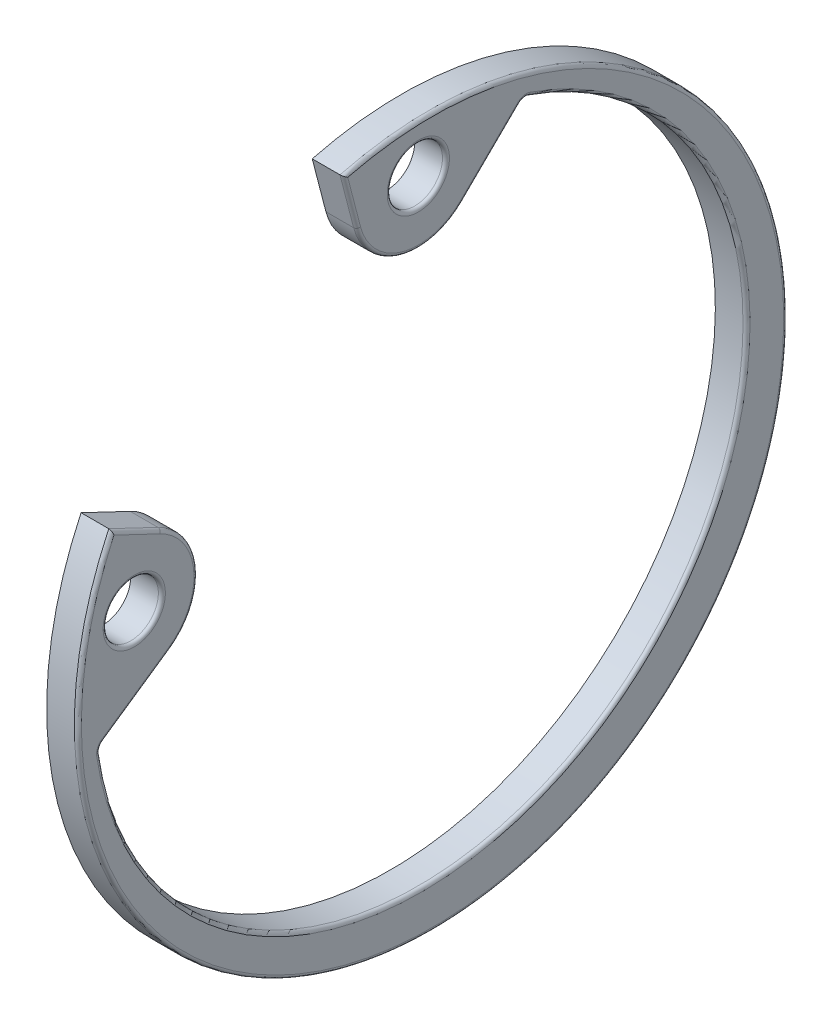
ISO-10303-21;
HEADER;
FILE_DESCRIPTION(('STEP AP214'),'2;1');
FILE_NAME('part.step','',(''),(''),'','','');
FILE_SCHEMA(('AUTOMOTIVE_DESIGN { 1 0 10303 214 1 1 1 1 }'));
ENDSEC;
DATA;
#1=APPLICATION_CONTEXT('core data for automotive mechanical design processes');
#2=APPLICATION_PROTOCOL_DEFINITION('international standard','automotive_design',2000,#1);
#3=PRODUCT_CONTEXT('',#1,'mechanical');
#4=PRODUCT('Part','Part','',(#3));
#5=PRODUCT_RELATED_PRODUCT_CATEGORY('part','',(#4));
#6=PRODUCT_DEFINITION_FORMATION('','',#4);
#7=PRODUCT_DEFINITION_CONTEXT('part definition',#1,'design');
#8=PRODUCT_DEFINITION('design','',#6,#7);
#9=PRODUCT_DEFINITION_SHAPE('','',#8);
#10=(LENGTH_UNIT() NAMED_UNIT(*) SI_UNIT(.MILLI.,.METRE.));
#11=(NAMED_UNIT(*) PLANE_ANGLE_UNIT() SI_UNIT($,.RADIAN.));
#12=(NAMED_UNIT(*) SI_UNIT($,.STERADIAN.) SOLID_ANGLE_UNIT());
#13=UNCERTAINTY_MEASURE_WITH_UNIT(LENGTH_MEASURE(1.E-05),#10,'distance_accuracy_value','');
#14=(GEOMETRIC_REPRESENTATION_CONTEXT(3) GLOBAL_UNCERTAINTY_ASSIGNED_CONTEXT((#13)) GLOBAL_UNIT_ASSIGNED_CONTEXT((#10,
#11,#12)) REPRESENTATION_CONTEXT('',''));
#15=CARTESIAN_POINT('',(0.,0.,0.));
#16=DIRECTION('',(0.,0.,1.));
#17=DIRECTION('',(1.,0.,0.));
#18=AXIS2_PLACEMENT_3D('',#15,#16,#17);
#19=CARTESIAN_POINT('',(0.89,-0.94437347459123,9.22877533610817));
#20=DIRECTION('',(1.,0.,0.));
#21=DIRECTION('',(0.,0.,-1.));
#22=AXIS2_PLACEMENT_3D('',#19,#20,#21);
#23=PLANE('',#22);
#24=CARTESIAN_POINT('',(0.89,8.74089053517137,0.405687887252676));
#25=DIRECTION('',(1.,0.,0.));
#26=DIRECTION('',(0.,0.,-1.));
#27=AXIS2_PLACEMENT_3D('',#24,#25,#26);
#28=CIRCLE('',#27,0.887399999999978);
#29=CARTESIAN_POINT('',(0.89,8.74089053517137,-0.481712112747302));
#30=VERTEX_POINT('',#29);
#31=EDGE_CURVE('E241',#30,#30,#28,.F.);
#32=ORIENTED_EDGE('',*,*,#31,.T.);
#33=EDGE_LOOP('',(#32));
#34=FACE_BOUND('',#33,.T.);
#35=CARTESIAN_POINT('',(0.89,8.88379246022824,-2.67214654899015));
#36=DIRECTION('',(1.,0.,0.));
#37=DIRECTION('',(0.,0.,-1.));
#38=AXIS2_PLACEMENT_3D('',#35,#36,#37);
#39=CIRCLE('',#38,0.354000000437606);
#40=CARTESIAN_POINT('',(0.89,9.13606218370444,-2.42380004322237));
#41=VERTEX_POINT('',#40);
#42=CARTESIAN_POINT('',(0.89,9.21781288839964,-2.78939139482152));
#43=VERTEX_POINT('',#42);
#44=EDGE_CURVE('E236',#41,#43,#39,.F.);
#45=ORIENTED_EDGE('',*,*,#44,.T.);
#46=CARTESIAN_POINT('',(0.89,0.37911789803553,0.313087806736716));
#47=DIRECTION('',(1.,0.,0.));
#48=DIRECTION('',(0.,0.,-1.));
#49=AXIS2_PLACEMENT_3D('',#46,#47,#48);
#50=CIRCLE('',#49,9.3673852450291);
#51=CARTESIAN_POINT('',(0.89,-0.996353496623198,9.57893826804163));
#52=VERTEX_POINT('',#51);
#53=EDGE_CURVE('E238',#43,#52,#50,.F.);
#54=ORIENTED_EDGE('',*,*,#53,.T.);
#55=CARTESIAN_POINT('',(0.89,-0.94437347459123,9.22877533610817));
#56=DIRECTION('',(1.,0.,0.));
#57=DIRECTION('',(0.,0.,-1.));
#58=AXIS2_PLACEMENT_3D('',#55,#56,#57);
#59=CIRCLE('',#58,0.354000002246724);
#60=CARTESIAN_POINT('',(0.89,-0.652811376367404,9.42954272506863));
#61=VERTEX_POINT('',#60);
#62=EDGE_CURVE('E220',#52,#61,#59,.F.);
#63=ORIENTED_EDGE('',*,*,#62,.T.);
#64=DIRECTION('',(0.,0.567139513119416,-0.823621741249387));
#65=VECTOR('',#64,1.);
#66=CARTESIAN_POINT('',(0.89,0.647978584774914,7.54048567999871));
#67=LINE('',#66,#65);
#68=CARTESIAN_POINT('',(0.89,0.647978584746839,7.54048568003948));
#69=VERTEX_POINT('',#68);
#70=EDGE_CURVE('E222',#61,#69,#67,.T.);
#71=ORIENTED_EDGE('',*,*,#70,.T.);
#72=CARTESIAN_POINT('',(0.89,2.05093585847453,8.50655112749294));
#73=DIRECTION('',(1.,0.,0.));
#74=DIRECTION('',(0.,0.,-1.));
#75=AXIS2_PLACEMENT_3D('',#72,#73,#74);
#76=CIRCLE('',#75,1.70340000019634);
#77=CARTESIAN_POINT('',(0.89,3.58905171428596,7.77458721118943));
#78=VERTEX_POINT('',#77);
#79=EDGE_CURVE('E224',#69,#78,#76,.T.);
#80=ORIENTED_EDGE('',*,*,#79,.T.);
#81=DIRECTION('',(0.,0.429707591985049,0.902968097659275));
#82=VECTOR('',#81,1.);
#83=CARTESIAN_POINT('',(0.89,4.25643186717224,9.17698967814012));
#84=LINE('',#83,#82);
#85=CARTESIAN_POINT('',(0.89,4.21324658262308,9.08624207450555));
#86=VERTEX_POINT('',#85);
#87=EDGE_CURVE('E226',#78,#86,#84,.T.);
#88=ORIENTED_EDGE('',*,*,#87,.T.);
#89=CARTESIAN_POINT('',(0.89,0.,0.));
#90=DIRECTION('',(1.,0.,0.));
#91=DIRECTION('',(0.,0.,-1.));
#92=AXIS2_PLACEMENT_3D('',#89,#90,#91);
#93=CIRCLE('',#92,10.01555);
#94=CARTESIAN_POINT('',(0.89,9.7189362692285,2.41940480225504));
#95=VERTEX_POINT('',#94);
#96=EDGE_CURVE('E228',#86,#95,#93,.T.);
#97=ORIENTED_EDGE('',*,*,#96,.T.);
#98=DIRECTION('',(0.,-0.96792441124204,-0.251241585176001));
#99=VECTOR('',#98,1.);
#100=CARTESIAN_POINT('',(0.89,8.31292562591993,2.05445032988474));
#101=LINE('',#100,#99);
#102=CARTESIAN_POINT('',(0.89,8.31292562594263,2.05445032989063));
#103=VERTEX_POINT('',#102);
#104=EDGE_CURVE('E230',#95,#103,#101,.T.);
#105=ORIENTED_EDGE('',*,*,#104,.T.);
#106=CARTESIAN_POINT('',(0.89,8.74089054125224,0.405687892758106));
#107=DIRECTION('',(1.,0.,0.));
#108=DIRECTION('',(0.,0.,-1.));
#109=AXIS2_PLACEMENT_3D('',#106,#107,#108);
#110=CIRCLE('',#109,1.70339999496159);
#111=CARTESIAN_POINT('',(0.89,7.52700284347939,-0.789321814328357));
#112=VERTEX_POINT('',#111);
#113=EDGE_CURVE('E232',#103,#112,#110,.T.);
#114=ORIENTED_EDGE('',*,*,#113,.T.);
#115=DIRECTION('',(0.,0.701543798907593,-0.712626338423092));
#116=VECTOR('',#115,1.);
#117=CARTESIAN_POINT('',(0.89,9.13606218388451,-2.42380004340528));
#118=LINE('',#117,#116);
#119=EDGE_CURVE('E234',#112,#41,#118,.T.);
#120=ORIENTED_EDGE('',*,*,#119,.T.);
#121=EDGE_LOOP('',(#45,#54,#63,#71,#80,#88,#97,#105,#114,#120));
#122=FACE_BOUND('',#121,.T.);
#123=CARTESIAN_POINT('',(0.89,2.05093585267198,8.50655112349735));
#124=DIRECTION('',(1.,0.,0.));
#125=DIRECTION('',(0.,0.,-1.));
#126=AXIS2_PLACEMENT_3D('',#123,#124,#125);
#127=CIRCLE('',#126,0.887399999999991);
#128=CARTESIAN_POINT('',(0.89,2.05093585267198,7.61915112349736));
#129=VERTEX_POINT('',#128);
#130=EDGE_CURVE('E217',#129,#129,#127,.F.);
#131=ORIENTED_EDGE('',*,*,#130,.T.);
#132=EDGE_LOOP('',(#131));
#133=FACE_BOUND('',#132,.T.);
#134=ADVANCED_FACE('F33',(#34,#122,#133),#23,.T.);
#135=CARTESIAN_POINT('',(0.,-0.94437347459123,9.22877533610817));
#136=DIRECTION('',(1.,0.,0.));
#137=DIRECTION('',(0.,0.,-1.));
#138=AXIS2_PLACEMENT_3D('',#135,#136,#137);
#139=PLANE('',#138);
#140=CARTESIAN_POINT('',(0.,-0.94437347459123,9.22877533610817));
#141=DIRECTION('',(-1.,0.,0.));
#142=DIRECTION('',(0.,0.,-1.));
#143=AXIS2_PLACEMENT_3D('',#140,#141,#142);
#144=CIRCLE('',#143,0.254000002246724);
#145=CARTESIAN_POINT('',(0.,-0.981669875114318,9.4800221861369));
#146=VERTEX_POINT('',#145);
#147=CARTESIAN_POINT('',(0.,-0.735173550492341,9.37282877375669));
#148=VERTEX_POINT('',#147);
#149=EDGE_CURVE('E162',#146,#148,#144,.T.);
#150=ORIENTED_EDGE('',*,*,#149,.F.);
#151=CARTESIAN_POINT('',(0.,0.37911789803553,0.313087806736716));
#152=DIRECTION('',(-1.,0.,0.));
#153=DIRECTION('',(0.,0.,-1.));
#154=AXIS2_PLACEMENT_3D('',#151,#152,#153);
#155=CIRCLE('',#154,9.2673852450291);
#156=CARTESIAN_POINT('',(0.,9.12345683535854,-2.75627138192139));
#157=VERTEX_POINT('',#156);
#158=EDGE_CURVE('E197',#157,#146,#155,.T.);
#159=ORIENTED_EDGE('',*,*,#158,.F.);
#160=CARTESIAN_POINT('',(0.,8.88379246022824,-2.67214654899015));
#161=DIRECTION('',(-1.,0.,0.));
#162=DIRECTION('',(0.,0.,-1.));
#163=AXIS2_PLACEMENT_3D('',#160,#161,#162);
#164=CIRCLE('',#163,0.254000000437606);
#165=CARTESIAN_POINT('',(0.,9.0647995500422,-2.49395442329604));
#166=VERTEX_POINT('',#165);
#167=EDGE_CURVE('E194',#166,#157,#164,.T.);
#168=ORIENTED_EDGE('',*,*,#167,.F.);
#169=DIRECTION('',(0.,0.701543798907593,-0.712626338423092));
#170=VECTOR('',#169,1.);
#171=CARTESIAN_POINT('',(0.,7.45574020963708,-0.859476194219118));
#172=LINE('',#171,#170);
#173=CARTESIAN_POINT('',(0.,7.45574020963708,-0.859476194219116));
#174=VERTEX_POINT('',#173);
#175=EDGE_CURVE('E191',#174,#166,#172,.T.);
#176=ORIENTED_EDGE('',*,*,#175,.F.);
#177=CARTESIAN_POINT('',(0.,8.74089054125224,0.405687892758106));
#178=DIRECTION('',(1.,0.,0.));
#179=DIRECTION('',(0.,0.,-1.));
#180=AXIS2_PLACEMENT_3D('',#177,#178,#179);
#181=CIRCLE('',#180,1.80339999496159);
#182=CARTESIAN_POINT('',(0.,8.28780146740233,2.15124277100894));
#183=VERTEX_POINT('',#182);
#184=EDGE_CURVE('E188',#183,#174,#181,.T.);
#185=ORIENTED_EDGE('',*,*,#184,.F.);
#186=DIRECTION('',(0.,-0.96792441124204,-0.251241585176));
#187=VECTOR('',#186,1.);
#188=CARTESIAN_POINT('',(0.,9.79108777455335,2.54144683074264));
#189=LINE('',#188,#187);
#190=CARTESIAN_POINT('',(0.,9.79108777455335,2.54144683074265));
#191=VERTEX_POINT('',#190);
#192=EDGE_CURVE('E185',#191,#183,#189,.T.);
#193=ORIENTED_EDGE('',*,*,#192,.F.);
#194=CARTESIAN_POINT('',(0.,0.,0.));
#195=DIRECTION('',(1.,0.,0.));
#196=DIRECTION('',(0.,0.,-1.));
#197=AXIS2_PLACEMENT_3D('',#194,#195,#196);
#198=CIRCLE('',#197,10.11555);
#199=CARTESIAN_POINT('',(0.,4.34672867693816,9.13401891894162));
#200=VERTEX_POINT('',#199);
#201=EDGE_CURVE('E182',#200,#191,#198,.T.);
#202=ORIENTED_EDGE('',*,*,#201,.F.);
#203=DIRECTION('',(0.,0.429707591985049,0.902968097659275));
#204=VECTOR('',#203,1.);
#205=CARTESIAN_POINT('',(0.,3.67934852405189,7.73161645199092));
#206=LINE('',#205,#204);
#207=CARTESIAN_POINT('',(0.,3.67934852405189,7.73161645199092));
#208=VERTEX_POINT('',#207);
#209=EDGE_CURVE('E179',#208,#200,#206,.T.);
#210=ORIENTED_EDGE('',*,*,#209,.F.);
#211=CARTESIAN_POINT('',(0.,2.05093585847453,8.50655112749294));
#212=DIRECTION('',(1.,0.,0.));
#213=DIRECTION('',(0.,0.,-1.));
#214=AXIS2_PLACEMENT_3D('',#211,#212,#213);
#215=CIRCLE('',#214,1.80340000019634);
#216=CARTESIAN_POINT('',(0.,0.565616410649975,7.48377172868677));
#217=VERTEX_POINT('',#216);
#218=EDGE_CURVE('E165',#217,#208,#215,.T.);
#219=ORIENTED_EDGE('',*,*,#218,.F.);
#220=DIRECTION('',(0.,0.567139513119416,-0.823621741249387));
#221=VECTOR('',#220,1.);
#222=CARTESIAN_POINT('',(0.,-0.735173550492341,9.37282877375669));
#223=LINE('',#222,#221);
#224=EDGE_CURVE('E149',#148,#217,#223,.T.);
#225=ORIENTED_EDGE('',*,*,#224,.F.);
#226=EDGE_LOOP('',(#150,#159,#168,#176,#185,#193,#202,#210,#219,#225));
#227=FACE_BOUND('',#226,.T.);
#228=CARTESIAN_POINT('',(0.,2.05093585267198,8.50655112349735));
#229=DIRECTION('',(1.,0.,0.));
#230=DIRECTION('',(0.,0.,-1.));
#231=AXIS2_PLACEMENT_3D('',#228,#229,#230);
#232=CIRCLE('',#231,0.787399999999991);
#233=CARTESIAN_POINT('',(0.,2.05093585267198,7.71915112349736));
#234=VERTEX_POINT('',#233);
#235=EDGE_CURVE('E171',#234,#234,#232,.T.);
#236=ORIENTED_EDGE('',*,*,#235,.T.);
#237=EDGE_LOOP('',(#236));
#238=FACE_BOUND('',#237,.T.);
#239=CARTESIAN_POINT('',(0.,8.74089053517137,0.405687887252676));
#240=DIRECTION('',(1.,0.,0.));
#241=DIRECTION('',(0.,0.,-1.));
#242=AXIS2_PLACEMENT_3D('',#239,#240,#241);
#243=CIRCLE('',#242,0.787399999999977);
#244=CARTESIAN_POINT('',(0.,8.74089053517137,-0.381712112747302));
#245=VERTEX_POINT('',#244);
#246=EDGE_CURVE('E174',#245,#245,#243,.T.);
#247=ORIENTED_EDGE('',*,*,#246,.T.);
#248=EDGE_LOOP('',(#247));
#249=FACE_BOUND('',#248,.T.);
#250=ADVANCED_FACE('F159',(#227,#238,#249),#139,.F.);
#251=CARTESIAN_POINT('',(0.89,-0.94437347459123,9.22877533610817));
#252=DIRECTION('',(-1.,0.,0.));
#253=DIRECTION('',(0.,0.,1.));
#254=AXIS2_PLACEMENT_3D('',#251,#252,#253);
#255=CYLINDRICAL_SURFACE('',#254,0.254000002246724);
#256=DIRECTION('',(-1.,0.,0.));
#257=VECTOR('',#256,1.);
#258=CARTESIAN_POINT('',(0.89,-0.735173550492341,9.37282877375669));
#259=LINE('',#258,#257);
#260=CARTESIAN_POINT('',(0.79,-0.735173550492341,9.37282877375669));
#261=VERTEX_POINT('',#260);
#262=EDGE_CURVE('E146',#261,#148,#259,.T.);
#263=ORIENTED_EDGE('',*,*,#262,.F.);
#264=CARTESIAN_POINT('',(0.79,-0.94437347459123,9.22877533610817));
#265=DIRECTION('',(1.,0.,0.));
#266=DIRECTION('',(0.,0.,-1.));
#267=AXIS2_PLACEMENT_3D('',#264,#265,#266);
#268=CIRCLE('',#267,0.254000002246724);
#269=CARTESIAN_POINT('',(0.79,-0.981669875114318,9.4800221861369));
#270=VERTEX_POINT('',#269);
#271=EDGE_CURVE('E47',#261,#270,#268,.T.);
#272=ORIENTED_EDGE('',*,*,#271,.T.);
#273=DIRECTION('',(-1.,0.,0.));
#274=VECTOR('',#273,1.);
#275=CARTESIAN_POINT('',(0.89,-0.981669875114318,9.4800221861369));
#276=LINE('',#275,#274);
#277=EDGE_CURVE('E169',#270,#146,#276,.T.);
#278=ORIENTED_EDGE('',*,*,#277,.T.);
#279=ORIENTED_EDGE('',*,*,#149,.T.);
#280=EDGE_LOOP('',(#263,#272,#278,#279));
#281=FACE_BOUND('',#280,.T.);
#282=ADVANCED_FACE('F167',(#281),#255,.F.);
#283=CARTESIAN_POINT('',(0.89,-0.735173550492341,9.37282877375669));
#284=DIRECTION('',(0.,0.823621741249387,0.567139513119416));
#285=DIRECTION('',(0.,-0.567139513119416,0.823621741249387));
#286=AXIS2_PLACEMENT_3D('',#283,#284,#285);
#287=PLANE('',#286);
#288=DIRECTION('',(-1.,0.,0.));
#289=VECTOR('',#288,1.);
#290=CARTESIAN_POINT('',(0.89,0.565616410649975,7.48377172868677));
#291=LINE('',#290,#289);
#292=CARTESIAN_POINT('',(0.79,0.565616410649975,7.48377172868677));
#293=VERTEX_POINT('',#292);
#294=EDGE_CURVE('E155',#293,#217,#291,.T.);
#295=ORIENTED_EDGE('',*,*,#294,.F.);
#296=DIRECTION('',(0.,0.567139513119416,-0.823621741249387));
#297=VECTOR('',#296,1.);
#298=CARTESIAN_POINT('',(0.79,-0.735173550492341,9.37282877375669));
#299=LINE('',#298,#297);
#300=EDGE_CURVE('E55',#293,#261,#299,.F.);
#301=ORIENTED_EDGE('',*,*,#300,.T.);
#302=ORIENTED_EDGE('',*,*,#262,.T.);
#303=ORIENTED_EDGE('',*,*,#224,.T.);
#304=EDGE_LOOP('',(#295,#301,#302,#303));
#305=FACE_BOUND('',#304,.T.);
#306=ADVANCED_FACE('F148',(#305),#287,.F.);
#307=CARTESIAN_POINT('',(0.89,2.05093585847453,8.50655112749294));
#308=DIRECTION('',(-1.,0.,0.));
#309=DIRECTION('',(0.,0.,1.));
#310=AXIS2_PLACEMENT_3D('',#307,#308,#309);
#311=CYLINDRICAL_SURFACE('',#310,1.80340000019634);
#312=DIRECTION('',(-1.,0.,0.));
#313=VECTOR('',#312,1.);
#314=CARTESIAN_POINT('',(0.89,3.67934852405189,7.73161645199092));
#315=LINE('',#314,#313);
#316=CARTESIAN_POINT('',(0.79,3.67934852405189,7.73161645199092));
#317=VERTEX_POINT('',#316);
#318=EDGE_CURVE('E212',#317,#208,#315,.T.);
#319=ORIENTED_EDGE('',*,*,#318,.F.);
#320=CARTESIAN_POINT('',(0.79,2.05093585847453,8.50655112749294));
#321=DIRECTION('',(1.,0.,0.));
#322=DIRECTION('',(0.,0.,-1.));
#323=AXIS2_PLACEMENT_3D('',#320,#321,#322);
#324=CIRCLE('',#323,1.80340000019634);
#325=EDGE_CURVE('E63',#317,#293,#324,.F.);
#326=ORIENTED_EDGE('',*,*,#325,.T.);
#327=ORIENTED_EDGE('',*,*,#294,.T.);
#328=ORIENTED_EDGE('',*,*,#218,.T.);
#329=EDGE_LOOP('',(#319,#326,#327,#328));
#330=FACE_BOUND('',#329,.T.);
#331=ADVANCED_FACE('F348',(#330),#311,.T.);
#332=CARTESIAN_POINT('',(0.89,3.67934852405189,7.73161645199092));
#333=DIRECTION('',(0.,-0.902968097659275,0.429707591985049));
#334=DIRECTION('',(0.,-0.429707591985049,-0.902968097659275));
#335=AXIS2_PLACEMENT_3D('',#332,#333,#334);
#336=PLANE('',#335);
#337=DIRECTION('',(-1.,0.,0.));
#338=VECTOR('',#337,1.);
#339=CARTESIAN_POINT('',(0.89,4.34672867693816,9.13401891894162));
#340=LINE('',#339,#338);
#341=CARTESIAN_POINT('',(0.79,4.34672867693816,9.13401891894162));
#342=VERTEX_POINT('',#341);
#343=EDGE_CURVE('E210',#342,#200,#340,.T.);
#344=ORIENTED_EDGE('',*,*,#343,.F.);
#345=DIRECTION('',(0.,0.429707591985049,0.902968097659275));
#346=VECTOR('',#345,1.);
#347=CARTESIAN_POINT('',(0.79,3.67934852405189,7.73161645199092));
#348=LINE('',#347,#346);
#349=EDGE_CURVE('E257',#342,#317,#348,.F.);
#350=ORIENTED_EDGE('',*,*,#349,.T.);
#351=ORIENTED_EDGE('',*,*,#318,.T.);
#352=ORIENTED_EDGE('',*,*,#209,.T.);
#353=EDGE_LOOP('',(#344,#350,#351,#352));
#354=FACE_BOUND('',#353,.T.);
#355=ADVANCED_FACE('F344',(#354),#336,.F.);
#356=CARTESIAN_POINT('',(0.89,0.,0.));
#357=DIRECTION('',(-1.,0.,0.));
#358=DIRECTION('',(0.,0.,1.));
#359=AXIS2_PLACEMENT_3D('',#356,#357,#358);
#360=CYLINDRICAL_SURFACE('',#359,10.11555);
#361=DIRECTION('',(-1.,0.,0.));
#362=VECTOR('',#361,1.);
#363=CARTESIAN_POINT('',(0.89,9.79108777455335,2.54144683074265));
#364=LINE('',#363,#362);
#365=CARTESIAN_POINT('',(0.79,9.79108777455335,2.54144683074265));
#366=VERTEX_POINT('',#365);
#367=EDGE_CURVE('E208',#366,#191,#364,.T.);
#368=ORIENTED_EDGE('',*,*,#367,.F.);
#369=CARTESIAN_POINT('',(0.79,0.,0.));
#370=DIRECTION('',(1.,0.,0.));
#371=DIRECTION('',(0.,0.,-1.));
#372=AXIS2_PLACEMENT_3D('',#369,#370,#371);
#373=CIRCLE('',#372,10.11555);
#374=EDGE_CURVE('E255',#366,#342,#373,.F.);
#375=ORIENTED_EDGE('',*,*,#374,.T.);
#376=ORIENTED_EDGE('',*,*,#343,.T.);
#377=ORIENTED_EDGE('',*,*,#201,.T.);
#378=EDGE_LOOP('',(#368,#375,#376,#377));
#379=FACE_BOUND('',#378,.T.);
#380=ADVANCED_FACE('F340',(#379),#360,.T.);
#381=CARTESIAN_POINT('',(0.89,9.79108777455335,2.54144683074264));
#382=DIRECTION('',(0.,0.251241585176001,-0.96792441124204));
#383=DIRECTION('',(0.,0.96792441124204,0.251241585176001));
#384=AXIS2_PLACEMENT_3D('',#381,#382,#383);
#385=PLANE('',#384);
#386=DIRECTION('',(-1.,0.,0.));
#387=VECTOR('',#386,1.);
#388=CARTESIAN_POINT('',(0.89,8.28780146740233,2.15124277100894));
#389=LINE('',#388,#387);
#390=CARTESIAN_POINT('',(0.79,8.28780146740233,2.15124277100894));
#391=VERTEX_POINT('',#390);
#392=EDGE_CURVE('E206',#391,#183,#389,.T.);
#393=ORIENTED_EDGE('',*,*,#392,.F.);
#394=DIRECTION('',(0.,-0.96792441124204,-0.251241585176001));
#395=VECTOR('',#394,1.);
#396=CARTESIAN_POINT('',(0.79,9.79108777455335,2.54144683074264));
#397=LINE('',#396,#395);
#398=EDGE_CURVE('E253',#391,#366,#397,.F.);
#399=ORIENTED_EDGE('',*,*,#398,.T.);
#400=ORIENTED_EDGE('',*,*,#367,.T.);
#401=ORIENTED_EDGE('',*,*,#192,.T.);
#402=EDGE_LOOP('',(#393,#399,#400,#401));
#403=FACE_BOUND('',#402,.T.);
#404=ADVANCED_FACE('F336',(#403),#385,.F.);
#405=CARTESIAN_POINT('',(0.89,8.74089054125224,0.405687892758106));
#406=DIRECTION('',(-1.,0.,0.));
#407=DIRECTION('',(0.,0.,1.));
#408=AXIS2_PLACEMENT_3D('',#405,#406,#407);
#409=CYLINDRICAL_SURFACE('',#408,1.80339999496159);
#410=DIRECTION('',(-1.,0.,0.));
#411=VECTOR('',#410,1.);
#412=CARTESIAN_POINT('',(0.89,7.45574020963708,-0.859476194219116));
#413=LINE('',#412,#411);
#414=CARTESIAN_POINT('',(0.79,7.45574020963708,-0.859476194219116));
#415=VERTEX_POINT('',#414);
#416=EDGE_CURVE('E204',#415,#174,#413,.T.);
#417=ORIENTED_EDGE('',*,*,#416,.F.);
#418=CARTESIAN_POINT('',(0.79,8.74089054125224,0.405687892758106));
#419=DIRECTION('',(1.,0.,0.));
#420=DIRECTION('',(0.,0.,-1.));
#421=AXIS2_PLACEMENT_3D('',#418,#419,#420);
#422=CIRCLE('',#421,1.80339999496159);
#423=EDGE_CURVE('E251',#415,#391,#422,.F.);
#424=ORIENTED_EDGE('',*,*,#423,.T.);
#425=ORIENTED_EDGE('',*,*,#392,.T.);
#426=ORIENTED_EDGE('',*,*,#184,.T.);
#427=EDGE_LOOP('',(#417,#424,#425,#426));
#428=FACE_BOUND('',#427,.T.);
#429=ADVANCED_FACE('F332',(#428),#409,.T.);
#430=CARTESIAN_POINT('',(0.89,7.45574020963708,-0.859476194219118));
#431=DIRECTION('',(0.,0.712626338423092,0.701543798907593));
#432=DIRECTION('',(0.,-0.701543798907593,0.712626338423092));
#433=AXIS2_PLACEMENT_3D('',#430,#431,#432);
#434=PLANE('',#433);
#435=DIRECTION('',(-1.,0.,0.));
#436=VECTOR('',#435,1.);
#437=CARTESIAN_POINT('',(0.89,9.0647995500422,-2.49395442329604));
#438=LINE('',#437,#436);
#439=CARTESIAN_POINT('',(0.79,9.0647995500422,-2.49395442329604));
#440=VERTEX_POINT('',#439);
#441=EDGE_CURVE('E202',#440,#166,#438,.T.);
#442=ORIENTED_EDGE('',*,*,#441,.F.);
#443=DIRECTION('',(0.,0.701543798907593,-0.712626338423092));
#444=VECTOR('',#443,1.);
#445=CARTESIAN_POINT('',(0.79,7.45574020963708,-0.859476194219118));
#446=LINE('',#445,#444);
#447=EDGE_CURVE('E249',#440,#415,#446,.F.);
#448=ORIENTED_EDGE('',*,*,#447,.T.);
#449=ORIENTED_EDGE('',*,*,#416,.T.);
#450=ORIENTED_EDGE('',*,*,#175,.T.);
#451=EDGE_LOOP('',(#442,#448,#449,#450));
#452=FACE_BOUND('',#451,.T.);
#453=ADVANCED_FACE('F328',(#452),#434,.F.);
#454=CARTESIAN_POINT('',(0.89,8.88379246022824,-2.67214654899015));
#455=DIRECTION('',(-1.,0.,0.));
#456=DIRECTION('',(0.,0.,1.));
#457=AXIS2_PLACEMENT_3D('',#454,#455,#456);
#458=CYLINDRICAL_SURFACE('',#457,0.254000000437606);
#459=DIRECTION('',(-1.,0.,0.));
#460=VECTOR('',#459,1.);
#461=CARTESIAN_POINT('',(0.89,9.12345683535854,-2.75627138192139));
#462=LINE('',#461,#460);
#463=CARTESIAN_POINT('',(0.79,9.12345683535854,-2.75627138192139));
#464=VERTEX_POINT('',#463);
#465=EDGE_CURVE('E200',#464,#157,#462,.T.);
#466=ORIENTED_EDGE('',*,*,#465,.F.);
#467=CARTESIAN_POINT('',(0.79,8.88379246022824,-2.67214654899015));
#468=DIRECTION('',(1.,0.,0.));
#469=DIRECTION('',(0.,0.,-1.));
#470=AXIS2_PLACEMENT_3D('',#467,#468,#469);
#471=CIRCLE('',#470,0.254000000437606);
#472=EDGE_CURVE('E247',#464,#440,#471,.T.);
#473=ORIENTED_EDGE('',*,*,#472,.T.);
#474=ORIENTED_EDGE('',*,*,#441,.T.);
#475=ORIENTED_EDGE('',*,*,#167,.T.);
#476=EDGE_LOOP('',(#466,#473,#474,#475));
#477=FACE_BOUND('',#476,.T.);
#478=ADVANCED_FACE('F324',(#477),#458,.F.);
#479=CARTESIAN_POINT('',(0.89,0.37911789803553,0.313087806736716));
#480=DIRECTION('',(-1.,0.,0.));
#481=DIRECTION('',(0.,0.,1.));
#482=AXIS2_PLACEMENT_3D('',#479,#480,#481);
#483=CYLINDRICAL_SURFACE('',#482,9.2673852450291);
#484=ORIENTED_EDGE('',*,*,#277,.F.);
#485=CARTESIAN_POINT('',(0.79,0.37911789803553,0.313087806736716));
#486=DIRECTION('',(1.,0.,0.));
#487=DIRECTION('',(0.,0.,-1.));
#488=AXIS2_PLACEMENT_3D('',#485,#486,#487);
#489=CIRCLE('',#488,9.2673852450291);
#490=EDGE_CURVE('E244',#270,#464,#489,.T.);
#491=ORIENTED_EDGE('',*,*,#490,.T.);
#492=ORIENTED_EDGE('',*,*,#465,.T.);
#493=ORIENTED_EDGE('',*,*,#158,.T.);
#494=EDGE_LOOP('',(#484,#491,#492,#493));
#495=FACE_BOUND('',#494,.T.);
#496=ADVANCED_FACE('F321',(#495),#483,.F.);
#497=CARTESIAN_POINT('',(0.89,2.05093585267198,8.50655112349735));
#498=DIRECTION('',(-1.,0.,0.));
#499=DIRECTION('',(0.,0.,1.));
#500=AXIS2_PLACEMENT_3D('',#497,#498,#499);
#501=CYLINDRICAL_SURFACE('',#500,0.787399999999991);
#502=CARTESIAN_POINT('',(0.79,2.05093585267198,8.50655112349735));
#503=DIRECTION('',(1.,0.,0.));
#504=DIRECTION('',(0.,0.,-1.));
#505=AXIS2_PLACEMENT_3D('',#502,#503,#504);
#506=CIRCLE('',#505,0.787399999999991);
#507=CARTESIAN_POINT('',(0.79,2.05093585267198,7.71915112349736));
#508=VERTEX_POINT('',#507);
#509=EDGE_CURVE('E11',#508,#508,#506,.T.);
#510=ORIENTED_EDGE('',*,*,#509,.T.);
#511=EDGE_LOOP('',(#510));
#512=FACE_BOUND('',#511,.T.);
#513=ORIENTED_EDGE('',*,*,#235,.F.);
#514=EDGE_LOOP('',(#513));
#515=FACE_BOUND('',#514,.T.);
#516=ADVANCED_FACE('F318',(#512,#515),#501,.F.);
#517=CARTESIAN_POINT('',(0.89,8.74089053517137,0.405687887252676));
#518=DIRECTION('',(-1.,0.,0.));
#519=DIRECTION('',(0.,0.,1.));
#520=AXIS2_PLACEMENT_3D('',#517,#518,#519);
#521=CYLINDRICAL_SURFACE('',#520,0.787399999999977);
#522=CARTESIAN_POINT('',(0.79,8.74089053517137,0.405687887252676));
#523=DIRECTION('',(1.,0.,0.));
#524=DIRECTION('',(0.,0.,-1.));
#525=AXIS2_PLACEMENT_3D('',#522,#523,#524);
#526=CIRCLE('',#525,0.787399999999977);
#527=CARTESIAN_POINT('',(0.79,8.74089053517137,-0.381712112747302));
#528=VERTEX_POINT('',#527);
#529=EDGE_CURVE('E154',#528,#528,#526,.T.);
#530=ORIENTED_EDGE('',*,*,#529,.T.);
#531=EDGE_LOOP('',(#530));
#532=FACE_BOUND('',#531,.T.);
#533=ORIENTED_EDGE('',*,*,#246,.F.);
#534=EDGE_LOOP('',(#533));
#535=FACE_BOUND('',#534,.T.);
#536=ADVANCED_FACE('F358',(#532,#535),#521,.F.);
#537=CARTESIAN_POINT('',(0.79,8.74089053517137,0.405687887252676));
#538=DIRECTION('',(1.,0.,0.));
#539=DIRECTION('',(0.,0.,-1.));
#540=AXIS2_PLACEMENT_3D('',#537,#538,#539);
#541=TOROIDAL_SURFACE('',#540,0.887399999999978,0.1);
#542=ORIENTED_EDGE('',*,*,#31,.F.);
#543=EDGE_LOOP('',(#542));
#544=FACE_BOUND('',#543,.T.);
#545=ORIENTED_EDGE('',*,*,#529,.F.);
#546=EDGE_LOOP('',(#545));
#547=FACE_BOUND('',#546,.T.);
#548=ADVANCED_FACE('F297',(#544,#547),#541,.T.);
#549=CARTESIAN_POINT('',(0.79,0.,0.));
#550=DIRECTION('',(1.,0.,0.));
#551=DIRECTION('',(0.,0.,-1.));
#552=AXIS2_PLACEMENT_3D('',#549,#550,#551);
#553=TOROIDAL_SURFACE('',#552,10.01555,0.1);
#554=CARTESIAN_POINT('',(0.79,4.34672867693816,9.13401891894162));
#555=CARTESIAN_POINT('',(0.794487451954682,4.34673875500211,9.13402246348739));
#556=CARTESIAN_POINT('',(0.798963558115462,4.3463268429482,9.13387622050107));
#557=CARTESIAN_POINT('',(0.807724473144493,4.34474684887549,9.13331507068113));
#558=CARTESIAN_POINT('',(0.81201060278404,4.34358534500622,9.13290250102691));
#559=CARTESIAN_POINT('',(0.820293857558006,4.34059538497308,9.13184011844747));
#560=CARTESIAN_POINT('',(0.824291737663343,4.33876875300578,9.1311909544074));
#561=CARTESIAN_POINT('',(0.831949546258281,4.33456009557264,9.129694605223));
#562=CARTESIAN_POINT('',(0.835608692475284,4.33217682719446,9.12884697691752));
#563=CARTESIAN_POINT('',(0.843961065708375,4.3259043039969,9.12661496952148));
#564=CARTESIAN_POINT('',(0.848469403795696,4.32179681528095,9.12515251218537));
#565=CARTESIAN_POINT('',(0.856728961036129,4.3129567606326,9.12200237159066));
#566=CARTESIAN_POINT('',(0.860478703454311,4.30822300462195,9.12031425946146));
#567=CARTESIAN_POINT('',(0.868569327932943,4.29639560395177,9.11609255820444));
#568=CARTESIAN_POINT('',(0.872574498765302,4.28909928536016,9.11348517383687));
#569=CARTESIAN_POINT('',(0.879302670534998,4.27400778250581,9.1080845979889));
#570=CARTESIAN_POINT('',(0.882024200887967,4.26621203763473,9.10529119756084));
#571=CARTESIAN_POINT('',(0.886041093565559,4.251223783303,9.09991282276679));
#572=CARTESIAN_POINT('',(0.887460776731901,4.2440597498302,9.09733890553612));
#573=CARTESIAN_POINT('',(0.889396245463372,4.22963861196235,9.09215091905138));
#574=CARTESIAN_POINT('',(0.889913793167325,4.22238171696207,9.08953693815696));
#575=CARTESIAN_POINT('',(0.88999669557293,4.21450080966692,9.08669451500589));
#576=CARTESIAN_POINT('',(0.889999994466216,4.2138736660813,9.08646829657466));
#577=CARTESIAN_POINT('',(0.89,4.21324658262308,9.08624207450555));
#578=B_SPLINE_CURVE_WITH_KNOTS('',3,(#554,#555,#556,#557,#558,#559,#560,#561,#562,#563,#564,
#565,#566,#567,#568,#569,#570,#571,#572,#573,#574,#575,#576,#577),.UNSPECIFIED.,.F.,.F.,(4,2,2,
2,2,2,2,2,2,2,2,4),(0.,0.0134231249708534,0.0267300263242841,0.040000703396783,
0.0533013007158669,0.0720126812994947,0.090760143496154,0.116786245579191,0.142842092103395,
0.166020036177901,0.189152655888405,0.191152730248473),.UNSPECIFIED.);
#579=EDGE_CURVE('E283',#342,#86,#578,.T.);
#580=ORIENTED_EDGE('',*,*,#579,.F.);
#581=ORIENTED_EDGE('',*,*,#374,.F.);
#582=CARTESIAN_POINT('',(0.79,9.79108777455335,2.54144683074265));
#583=CARTESIAN_POINT('',(0.794487451950212,9.79109316054646,2.54145605691501));
#584=CARTESIAN_POINT('',(0.79896355810647,9.79087167836922,2.54107922247351));
#585=CARTESIAN_POINT('',(0.807724473126304,9.79002193294286,2.53963381488435));
#586=CARTESIAN_POINT('',(0.812010602761181,9.7893972083965,2.53857125938091));
#587=CARTESIAN_POINT('',(0.820293857525796,9.78778869975876,2.5358360779067));
#588=CARTESIAN_POINT('',(0.824291737626457,9.7868058977351,2.53416512055454));
#589=CARTESIAN_POINT('',(0.831949546212386,9.78454084040358,2.53031526685235));
#590=CARTESIAN_POINT('',(0.835608692425052,9.78325791494018,2.52813523379018));
#591=CARTESIAN_POINT('',(0.843961065654115,9.779880269572,2.5223978200845));
#592=CARTESIAN_POINT('',(0.848469403741161,9.7776676199491,2.51864090290818));
#593=CARTESIAN_POINT('',(0.85672896098112,9.77290297873522,2.51055584594483));
#594=CARTESIAN_POINT('',(0.860478703399098,9.77035034101042,2.50622661862512));
#595=CARTESIAN_POINT('',(0.868569327885626,9.76396867280195,2.49541068226539));
#596=CARTESIAN_POINT('',(0.872574498724151,9.76002886015052,2.48873890628618));
#597=CARTESIAN_POINT('',(0.879302670504568,9.75187246250464,2.47494061449912));
#598=CARTESIAN_POINT('',(0.882024200862079,9.74765556634147,2.46781358769727));
#599=CARTESIAN_POINT('',(0.886041093551397,9.73954048965583,2.45411248500171));
#600=CARTESIAN_POINT('',(0.887460776723116,9.73565855056434,2.4475642810623));
#601=CARTESIAN_POINT('',(0.889396245461676,9.72783764837552,2.43438407196399));
#602=CARTESIAN_POINT('',(0.889913793167348,9.72389881163277,2.42775225571808));
#603=CARTESIAN_POINT('',(0.889996695572942,9.71961767592877,2.4205508706617));
#604=CARTESIAN_POINT('',(0.889999994466216,9.71927696868088,2.41997780659297));
#605=CARTESIAN_POINT('',(0.89,9.7189362692285,2.41940480225504));
#606=B_SPLINE_CURVE_WITH_KNOTS('',3,(#582,#583,#584,#585,#586,#587,#588,#589,#590,#591,#592,
#593,#594,#595,#596,#597,#598,#599,#600,#601,#602,#603,#604,#605),.UNSPECIFIED.,.F.,.F.,(4,2,2,
2,2,2,2,2,2,2,2,4),(0.,0.0134231249573477,0.0267300262969141,0.0400007033553532,
0.0533013006604846,0.0720126812463111,0.0907601434452686,0.11678624557341,0.142842092143026,
0.166020036303974,0.189152656100731,0.191152730460833),.UNSPECIFIED.);
#607=EDGE_CURVE('E37',#95,#366,#606,.F.);
#608=ORIENTED_EDGE('',*,*,#607,.F.);
#609=ORIENTED_EDGE('',*,*,#96,.F.);
#610=EDGE_LOOP('',(#580,#581,#608,#609));
#611=FACE_BOUND('',#610,.T.);
#612=ADVANCED_FACE('F293',(#611),#553,.T.);
#613=CARTESIAN_POINT('',(0.79,1.38464175035074,0.256093967311242));
#614=DIRECTION('',(0.,0.96792441124204,0.251241585176001));
#615=DIRECTION('',(0.,-0.251241585176001,0.96792441124204));
#616=AXIS2_PLACEMENT_3D('',#613,#614,#615);
#617=CYLINDRICAL_SURFACE('',#616,0.1);
#618=ORIENTED_EDGE('',*,*,#607,.T.);
#619=ORIENTED_EDGE('',*,*,#398,.F.);
#620=CARTESIAN_POINT('',(0.79,8.31292562594263,2.05445032989063));
#621=DIRECTION('',(0.,-0.967924411183118,-0.251241585403001));
#622=DIRECTION('',(0.,0.251241585403001,-0.967924411183118));
#623=AXIS2_PLACEMENT_3D('',#620,#621,#622);
#624=CIRCLE('',#623,0.1);
#625=EDGE_CURVE('E281',#103,#391,#624,.T.);
#626=ORIENTED_EDGE('',*,*,#625,.F.);
#627=ORIENTED_EDGE('',*,*,#104,.F.);
#628=EDGE_LOOP('',(#618,#619,#626,#627));
#629=FACE_BOUND('',#628,.T.);
#630=ADVANCED_FACE('F296',(#629),#617,.T.);
#631=CARTESIAN_POINT('',(0.79,3.31620383546603,7.20123701984124));
#632=DIRECTION('',(0.,-0.429707591985049,-0.902968097659275));
#633=DIRECTION('',(0.,0.902968097659275,-0.429707591985049));
#634=AXIS2_PLACEMENT_3D('',#631,#632,#633);
#635=CYLINDRICAL_SURFACE('',#634,0.1);
#636=ORIENTED_EDGE('',*,*,#579,.T.);
#637=ORIENTED_EDGE('',*,*,#87,.F.);
#638=CARTESIAN_POINT('',(0.79,3.58905171428596,7.77458721118943));
#639=DIRECTION('',(0.,-0.42970759198505,-0.902968097659275));
#640=DIRECTION('',(0.,0.902968097659275,-0.42970759198505));
#641=AXIS2_PLACEMENT_3D('',#638,#639,#640);
#642=CIRCLE('',#641,0.1);
#643=EDGE_CURVE('E278',#317,#78,#642,.T.);
#644=ORIENTED_EDGE('',*,*,#643,.F.);
#645=ORIENTED_EDGE('',*,*,#349,.F.);
#646=EDGE_LOOP('',(#636,#637,#644,#645));
#647=FACE_BOUND('',#646,.T.);
#648=ADVANCED_FACE('F290',(#647),#635,.T.);
#649=CARTESIAN_POINT('',(0.79,8.74089054125224,0.405687892758106));
#650=DIRECTION('',(1.,0.,0.));
#651=DIRECTION('',(0.,0.,-1.));
#652=AXIS2_PLACEMENT_3D('',#649,#650,#651);
#653=TOROIDAL_SURFACE('',#652,1.70339999496159,0.1);
#654=ORIENTED_EDGE('',*,*,#625,.T.);
#655=ORIENTED_EDGE('',*,*,#423,.F.);
#656=CARTESIAN_POINT('',(0.79,7.52700284347939,-0.789321814328357));
#657=DIRECTION('',(0.,0.701543798907592,-0.712626338423092));
#658=DIRECTION('',(0.,0.712626338423092,0.701543798907592));
#659=AXIS2_PLACEMENT_3D('',#656,#657,#658);
#660=CIRCLE('',#659,0.1);
#661=EDGE_CURVE('E275',#112,#415,#660,.T.);
#662=ORIENTED_EDGE('',*,*,#661,.F.);
#663=ORIENTED_EDGE('',*,*,#113,.F.);
#664=EDGE_LOOP('',(#654,#655,#662,#663));
#665=FACE_BOUND('',#664,.T.);
#666=ADVANCED_FACE('F306',(#665),#653,.T.);
#667=CARTESIAN_POINT('',(0.79,2.05093585847453,8.50655112749294));
#668=DIRECTION('',(1.,0.,0.));
#669=DIRECTION('',(0.,0.,-1.));
#670=AXIS2_PLACEMENT_3D('',#667,#668,#669);
#671=TOROIDAL_SURFACE('',#670,1.70340000019634,0.1);
#672=ORIENTED_EDGE('',*,*,#643,.T.);
#673=ORIENTED_EDGE('',*,*,#79,.F.);
#674=CARTESIAN_POINT('',(0.79,0.647978584746837,7.54048568003948));
#675=DIRECTION('',(0.,-0.567139513527126,0.82362174096864));
#676=DIRECTION('',(0.,-0.823621740968641,-0.567139513527126));
#677=AXIS2_PLACEMENT_3D('',#674,#675,#676);
#678=CIRCLE('',#677,0.1);
#679=EDGE_CURVE('E272',#293,#69,#678,.T.);
#680=ORIENTED_EDGE('',*,*,#679,.F.);
#681=ORIENTED_EDGE('',*,*,#325,.F.);
#682=EDGE_LOOP('',(#672,#673,#680,#681));
#683=FACE_BOUND('',#682,.T.);
#684=ADVANCED_FACE('F379',(#683),#671,.T.);
#685=CARTESIAN_POINT('',(0.79,-1.65073443487936,8.53339947815561));
#686=DIRECTION('',(0.,-0.701543798907593,0.712626338423092));
#687=DIRECTION('',(0.,-0.712626338423092,-0.701543798907593));
#688=AXIS2_PLACEMENT_3D('',#685,#686,#687);
#689=CYLINDRICAL_SURFACE('',#688,0.1);
#690=ORIENTED_EDGE('',*,*,#661,.T.);
#691=ORIENTED_EDGE('',*,*,#447,.F.);
#692=CARTESIAN_POINT('',(0.79,9.13606218370444,-2.42380004322237));
#693=DIRECTION('',(0.,0.701543800736663,-0.712626336622467));
#694=DIRECTION('',(0.,0.712626336622467,0.701543800736663));
#695=AXIS2_PLACEMENT_3D('',#692,#693,#694);
#696=CIRCLE('',#695,0.1);
#697=EDGE_CURVE('E269',#41,#440,#696,.T.);
#698=ORIENTED_EDGE('',*,*,#697,.F.);
#699=ORIENTED_EDGE('',*,*,#119,.F.);
#700=EDGE_LOOP('',(#690,#691,#698,#699));
#701=FACE_BOUND('',#700,.T.);
#702=ADVANCED_FACE('F375',(#701),#689,.T.);
#703=CARTESIAN_POINT('',(0.79,-0.652811376338494,9.42954272502665));
#704=DIRECTION('',(0.,-0.567139513119416,0.823621741249387));
#705=DIRECTION('',(0.,-0.823621741249387,-0.567139513119416));
#706=AXIS2_PLACEMENT_3D('',#703,#704,#705);
#707=CYLINDRICAL_SURFACE('',#706,0.1);
#708=ORIENTED_EDGE('',*,*,#679,.T.);
#709=ORIENTED_EDGE('',*,*,#70,.F.);
#710=CARTESIAN_POINT('',(0.79,-0.652811376367402,9.42954272506863));
#711=DIRECTION('',(0.,-0.567139513119421,0.823621741249384));
#712=DIRECTION('',(0.,-0.823621741249384,-0.567139513119421));
#713=AXIS2_PLACEMENT_3D('',#710,#711,#712);
#714=CIRCLE('',#713,0.1);
#715=EDGE_CURVE('E266',#261,#61,#714,.T.);
#716=ORIENTED_EDGE('',*,*,#715,.F.);
#717=ORIENTED_EDGE('',*,*,#300,.F.);
#718=EDGE_LOOP('',(#708,#709,#716,#717));
#719=FACE_BOUND('',#718,.T.);
#720=ADVANCED_FACE('F371',(#719),#707,.T.);
#721=CARTESIAN_POINT('',(0.79,8.88379246022824,-2.67214654899015));
#722=DIRECTION('',(1.,0.,0.));
#723=DIRECTION('',(0.,0.,-1.));
#724=AXIS2_PLACEMENT_3D('',#721,#722,#723);
#725=TOROIDAL_SURFACE('',#724,0.354000000437606,0.1);
#726=ORIENTED_EDGE('',*,*,#697,.T.);
#727=ORIENTED_EDGE('',*,*,#472,.F.);
#728=CARTESIAN_POINT('',(0.79,9.21781288839964,-2.78939139482152));
#729=DIRECTION('',(0.,-0.331200129001269,-0.943560530411029));
#730=DIRECTION('',(0.,0.943560530411029,-0.331200129001269));
#731=AXIS2_PLACEMENT_3D('',#728,#729,#730);
#732=CIRCLE('',#731,0.1);
#733=EDGE_CURVE('E264',#43,#464,#732,.T.);
#734=ORIENTED_EDGE('',*,*,#733,.F.);
#735=ORIENTED_EDGE('',*,*,#44,.F.);
#736=EDGE_LOOP('',(#726,#727,#734,#735));
#737=FACE_BOUND('',#736,.T.);
#738=ADVANCED_FACE('F367',(#737),#725,.T.);
#739=CARTESIAN_POINT('',(0.79,-0.94437347459123,9.22877533610817));
#740=DIRECTION('',(1.,0.,0.));
#741=DIRECTION('',(0.,0.,-1.));
#742=AXIS2_PLACEMENT_3D('',#739,#740,#741);
#743=TOROIDAL_SURFACE('',#742,0.354000002246724,0.1);
#744=ORIENTED_EDGE('',*,*,#715,.T.);
#745=ORIENTED_EDGE('',*,*,#62,.F.);
#746=CARTESIAN_POINT('',(0.79,-0.99635349723762,9.57893826795042));
#747=DIRECTION('',(6.21154989085965E-09,-0.989160818135255,-0.14683622123302));
#748=DIRECTION('',(0.,0.14683622123302,-0.989160818135255));
#749=AXIS2_PLACEMENT_3D('',#746,#747,#748);
#750=CIRCLE('',#749,0.1);
#751=EDGE_CURVE('E262',#270,#52,#750,.T.);
#752=ORIENTED_EDGE('',*,*,#751,.F.);
#753=ORIENTED_EDGE('',*,*,#271,.F.);
#754=EDGE_LOOP('',(#744,#745,#752,#753));
#755=FACE_BOUND('',#754,.T.);
#756=ADVANCED_FACE('F363',(#755),#743,.T.);
#757=CARTESIAN_POINT('',(0.79,0.37911789803553,0.313087806736716));
#758=DIRECTION('',(1.,0.,0.));
#759=DIRECTION('',(0.,0.,-1.));
#760=AXIS2_PLACEMENT_3D('',#757,#758,#759);
#761=TOROIDAL_SURFACE('',#760,9.3673852450291,0.1);
#762=ORIENTED_EDGE('',*,*,#733,.T.);
#763=ORIENTED_EDGE('',*,*,#490,.F.);
#764=ORIENTED_EDGE('',*,*,#751,.T.);
#765=ORIENTED_EDGE('',*,*,#53,.F.);
#766=EDGE_LOOP('',(#762,#763,#764,#765));
#767=FACE_BOUND('',#766,.T.);
#768=ADVANCED_FACE('F360',(#767),#761,.T.);
#769=CARTESIAN_POINT('',(0.79,2.05093585267198,8.50655112349735));
#770=DIRECTION('',(1.,0.,0.));
#771=DIRECTION('',(0.,0.,-1.));
#772=AXIS2_PLACEMENT_3D('',#769,#770,#771);
#773=TOROIDAL_SURFACE('',#772,0.887399999999991,0.1);
#774=ORIENTED_EDGE('',*,*,#130,.F.);
#775=EDGE_LOOP('',(#774));
#776=FACE_BOUND('',#775,.T.);
#777=ORIENTED_EDGE('',*,*,#509,.F.);
#778=EDGE_LOOP('',(#777));
#779=FACE_BOUND('',#778,.T.);
#780=ADVANCED_FACE('F35',(#776,#779),#773,.T.);
#781=CLOSED_SHELL('',(#134,#250,#282,#306,#331,#355,#380,#404,#429,#453,#478,#496,#516,#536,
#548,#612,#630,#648,#666,#684,#702,#720,#738,#756,#768,#780));
#782=MANIFOLD_SOLID_BREP('B2',#781);
#783=ADVANCED_BREP_SHAPE_REPRESENTATION('',(#18,#782),#14);
#784=SHAPE_DEFINITION_REPRESENTATION(#9,#783);
ENDSEC;
END-ISO-10303-21;
